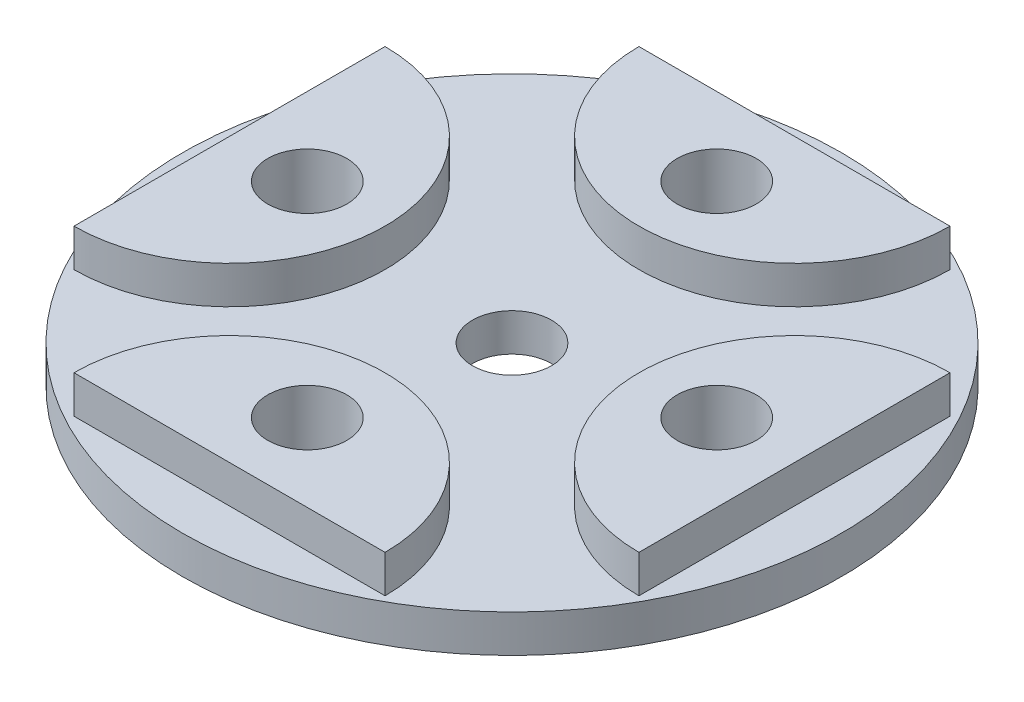
ISO-10303-21;
HEADER;
FILE_DESCRIPTION(('STEP AP214'),'2;1');
FILE_NAME('part.step','',(''),(''),'','','');
FILE_SCHEMA(('AUTOMOTIVE_DESIGN { 1 0 10303 214 1 1 1 1 }'));
ENDSEC;
DATA;
#1=APPLICATION_CONTEXT('core data for automotive mechanical design processes');
#2=APPLICATION_PROTOCOL_DEFINITION('international standard','automotive_design',2000,#1);
#3=PRODUCT_CONTEXT('',#1,'mechanical');
#4=PRODUCT('Part','Part','',(#3));
#5=PRODUCT_RELATED_PRODUCT_CATEGORY('part','',(#4));
#6=PRODUCT_DEFINITION_FORMATION('','',#4);
#7=PRODUCT_DEFINITION_CONTEXT('part definition',#1,'design');
#8=PRODUCT_DEFINITION('design','',#6,#7);
#9=PRODUCT_DEFINITION_SHAPE('','',#8);
#10=(LENGTH_UNIT() NAMED_UNIT(*) SI_UNIT(.MILLI.,.METRE.));
#11=(NAMED_UNIT(*) PLANE_ANGLE_UNIT() SI_UNIT($,.RADIAN.));
#12=(NAMED_UNIT(*) SI_UNIT($,.STERADIAN.) SOLID_ANGLE_UNIT());
#13=UNCERTAINTY_MEASURE_WITH_UNIT(LENGTH_MEASURE(1.E-05),#10,'distance_accuracy_value','');
#14=(GEOMETRIC_REPRESENTATION_CONTEXT(3) GLOBAL_UNCERTAINTY_ASSIGNED_CONTEXT((#13)) GLOBAL_UNIT_ASSIGNED_CONTEXT((#10,
#11,#12)) REPRESENTATION_CONTEXT('',''));
#15=CARTESIAN_POINT('',(0.,0.,0.));
#16=DIRECTION('',(0.,0.,1.));
#17=DIRECTION('',(1.,0.,0.));
#18=AXIS2_PLACEMENT_3D('',#15,#16,#17);
#19=CARTESIAN_POINT('',(0.,2.,0.));
#20=DIRECTION('',(0.,1.,0.));
#21=DIRECTION('',(0.,0.,1.));
#22=AXIS2_PLACEMENT_3D('',#19,#20,#21);
#23=PLANE('',#22);
#24=CARTESIAN_POINT('',(0.,2.,0.));
#25=DIRECTION('',(0.,1.,0.));
#26=DIRECTION('',(0.,0.,1.));
#27=AXIS2_PLACEMENT_3D('',#24,#25,#26);
#28=CIRCLE('',#27,17.5);
#29=CARTESIAN_POINT('',(0.,2.,17.5));
#30=VERTEX_POINT('',#29);
#31=EDGE_CURVE('E11',#30,#30,#28,.T.);
#32=ORIENTED_EDGE('',*,*,#31,.T.);
#33=EDGE_LOOP('',(#32));
#34=FACE_BOUND('',#33,.T.);
#35=CARTESIAN_POINT('',(0.,2.,0.));
#36=DIRECTION('',(0.,1.,0.));
#37=DIRECTION('',(0.,0.,1.));
#38=AXIS2_PLACEMENT_3D('',#35,#36,#37);
#39=CIRCLE('',#38,2.1);
#40=CARTESIAN_POINT('',(0.,2.,2.1));
#41=VERTEX_POINT('',#40);
#42=EDGE_CURVE('E167',#41,#41,#39,.T.);
#43=ORIENTED_EDGE('',*,*,#42,.F.);
#44=EDGE_LOOP('',(#43));
#45=FACE_BOUND('',#44,.T.);
#46=DIRECTION('',(1.,0.,0.));
#47=VECTOR('',#46,1.);
#48=CARTESIAN_POINT('',(0.,2.,-15.));
#49=LINE('',#48,#47);
#50=CARTESIAN_POINT('',(-8.26,2.,-15.));
#51=VERTEX_POINT('',#50);
#52=CARTESIAN_POINT('',(8.26,2.,-15.));
#53=VERTEX_POINT('',#52);
#54=EDGE_CURVE('E160',#51,#53,#49,.T.);
#55=ORIENTED_EDGE('',*,*,#54,.T.);
#56=CARTESIAN_POINT('',(0.,2.,-15.));
#57=DIRECTION('',(0.,1.,0.));
#58=DIRECTION('',(0.,0.,1.));
#59=AXIS2_PLACEMENT_3D('',#56,#57,#58);
#60=CIRCLE('',#59,8.26);
#61=EDGE_CURVE('E163',#53,#51,#60,.F.);
#62=ORIENTED_EDGE('',*,*,#61,.T.);
#63=EDGE_LOOP('',(#55,#62));
#64=FACE_BOUND('',#63,.T.);
#65=DIRECTION('',(0.,0.,1.));
#66=VECTOR('',#65,1.);
#67=CARTESIAN_POINT('',(15.,2.,0.));
#68=LINE('',#67,#66);
#69=CARTESIAN_POINT('',(15.,2.,-8.25999999999995));
#70=VERTEX_POINT('',#69);
#71=CARTESIAN_POINT('',(15.,2.,8.26000000000005));
#72=VERTEX_POINT('',#71);
#73=EDGE_CURVE('E144',#70,#72,#68,.T.);
#74=ORIENTED_EDGE('',*,*,#73,.T.);
#75=CARTESIAN_POINT('',(15.,2.,0.));
#76=DIRECTION('',(0.,1.,0.));
#77=DIRECTION('',(0.,0.,1.));
#78=AXIS2_PLACEMENT_3D('',#75,#76,#77);
#79=CIRCLE('',#78,8.26);
#80=EDGE_CURVE('E147',#72,#70,#79,.F.);
#81=ORIENTED_EDGE('',*,*,#80,.T.);
#82=EDGE_LOOP('',(#74,#81));
#83=FACE_BOUND('',#82,.T.);
#84=DIRECTION('',(-1.,0.,0.));
#85=VECTOR('',#84,1.);
#86=CARTESIAN_POINT('',(-1.03957399589409E-13,2.,15.));
#87=LINE('',#86,#85);
#88=CARTESIAN_POINT('',(8.2599999999999,2.,15.0000000000001));
#89=VERTEX_POINT('',#88);
#90=CARTESIAN_POINT('',(-8.2600000000001,2.,14.9999999999999));
#91=VERTEX_POINT('',#90);
#92=EDGE_CURVE('E128',#89,#91,#87,.T.);
#93=ORIENTED_EDGE('',*,*,#92,.T.);
#94=CARTESIAN_POINT('',(-1.04744440165294E-13,2.,15.));
#95=DIRECTION('',(0.,1.,0.));
#96=DIRECTION('',(0.,0.,1.));
#97=AXIS2_PLACEMENT_3D('',#94,#95,#96);
#98=CIRCLE('',#97,8.26);
#99=EDGE_CURVE('E131',#91,#89,#98,.F.);
#100=ORIENTED_EDGE('',*,*,#99,.T.);
#101=EDGE_LOOP('',(#93,#100));
#102=FACE_BOUND('',#101,.T.);
#103=DIRECTION('',(0.,0.,-1.));
#104=VECTOR('',#103,1.);
#105=CARTESIAN_POINT('',(-15.,2.,-1.57511211499105E-13));
#106=LINE('',#105,#104);
#107=CARTESIAN_POINT('',(-15.0000000000001,2.,8.25999999999984));
#108=VERTEX_POINT('',#107);
#109=CARTESIAN_POINT('',(-14.9999999999999,2.,-8.26000000000016));
#110=VERTEX_POINT('',#109);
#111=EDGE_CURVE('E113',#108,#110,#106,.T.);
#112=ORIENTED_EDGE('',*,*,#111,.T.);
#113=CARTESIAN_POINT('',(-15.,2.,-1.57116660247941E-13));
#114=DIRECTION('',(0.,1.,0.));
#115=DIRECTION('',(0.,0.,1.));
#116=AXIS2_PLACEMENT_3D('',#113,#114,#115);
#117=CIRCLE('',#116,8.26);
#118=EDGE_CURVE('E111',#110,#108,#117,.F.);
#119=ORIENTED_EDGE('',*,*,#118,.T.);
#120=EDGE_LOOP('',(#112,#119));
#121=FACE_BOUND('',#120,.T.);
#122=ADVANCED_FACE('F33',(#34,#45,#64,#83,#102,#121),#23,.T.);
#123=CARTESIAN_POINT('',(0.,0.,0.));
#124=DIRECTION('',(0.,1.,0.));
#125=DIRECTION('',(0.,0.,1.));
#126=AXIS2_PLACEMENT_3D('',#123,#124,#125);
#127=PLANE('',#126);
#128=CARTESIAN_POINT('',(0.,0.,-10.87));
#129=DIRECTION('',(0.,1.,0.));
#130=DIRECTION('',(0.,0.,1.));
#131=AXIS2_PLACEMENT_3D('',#128,#129,#130);
#132=CIRCLE('',#131,2.1);
#133=CARTESIAN_POINT('',(0.,0.,-8.77));
#134=VERTEX_POINT('',#133);
#135=EDGE_CURVE('E107',#134,#134,#132,.T.);
#136=ORIENTED_EDGE('',*,*,#135,.T.);
#137=EDGE_LOOP('',(#136));
#138=FACE_BOUND('',#137,.T.);
#139=CARTESIAN_POINT('',(10.8700000000003,0.,-3.05682747082362E-13));
#140=DIRECTION('',(0.,1.,0.));
#141=DIRECTION('',(0.,0.,1.));
#142=AXIS2_PLACEMENT_3D('',#139,#140,#141);
#143=CIRCLE('',#142,2.10000000000024);
#144=CARTESIAN_POINT('',(10.8700000000003,0.,2.09999999999993));
#145=VERTEX_POINT('',#144);
#146=EDGE_CURVE('E383',#145,#145,#143,.T.);
#147=ORIENTED_EDGE('',*,*,#146,.T.);
#148=EDGE_LOOP('',(#147));
#149=FACE_BOUND('',#148,.T.);
#150=CARTESIAN_POINT('',(6.11977916259443E-13,0.,10.87));
#151=DIRECTION('',(0.,1.,0.));
#152=DIRECTION('',(0.,0.,1.));
#153=AXIS2_PLACEMENT_3D('',#150,#151,#152);
#154=CIRCLE('',#153,2.1);
#155=CARTESIAN_POINT('',(6.11977916259443E-13,0.,12.97));
#156=VERTEX_POINT('',#155);
#157=EDGE_CURVE('E392',#156,#156,#154,.T.);
#158=ORIENTED_EDGE('',*,*,#157,.T.);
#159=EDGE_LOOP('',(#158));
#160=FACE_BOUND('',#159,.T.);
#161=CARTESIAN_POINT('',(-10.8699999999997,0.,3.03847658839063E-13));
#162=DIRECTION('',(0.,1.,0.));
#163=DIRECTION('',(0.,0.,1.));
#164=AXIS2_PLACEMENT_3D('',#161,#162,#163);
#165=CIRCLE('',#164,2.1);
#166=CARTESIAN_POINT('',(-10.8699999999997,0.,2.1000000000003));
#167=VERTEX_POINT('',#166);
#168=EDGE_CURVE('E398',#167,#167,#165,.T.);
#169=ORIENTED_EDGE('',*,*,#168,.T.);
#170=EDGE_LOOP('',(#169));
#171=FACE_BOUND('',#170,.T.);
#172=CARTESIAN_POINT('',(0.,0.,0.));
#173=DIRECTION('',(0.,1.,0.));
#174=DIRECTION('',(0.,0.,1.));
#175=AXIS2_PLACEMENT_3D('',#172,#173,#174);
#176=CIRCLE('',#175,17.5);
#177=CARTESIAN_POINT('',(0.,0.,17.5));
#178=VERTEX_POINT('',#177);
#179=EDGE_CURVE('E37',#178,#178,#176,.T.);
#180=ORIENTED_EDGE('',*,*,#179,.F.);
#181=EDGE_LOOP('',(#180));
#182=FACE_BOUND('',#181,.T.);
#183=CARTESIAN_POINT('',(0.,0.,0.));
#184=DIRECTION('',(0.,1.,0.));
#185=DIRECTION('',(0.,0.,1.));
#186=AXIS2_PLACEMENT_3D('',#183,#184,#185);
#187=CIRCLE('',#186,2.1);
#188=CARTESIAN_POINT('',(0.,0.,2.1));
#189=VERTEX_POINT('',#188);
#190=EDGE_CURVE('E166',#189,#189,#187,.T.);
#191=ORIENTED_EDGE('',*,*,#190,.T.);
#192=EDGE_LOOP('',(#191));
#193=FACE_BOUND('',#192,.T.);
#194=ADVANCED_FACE('F173',(#138,#149,#160,#171,#182,#193),#127,.F.);
#195=CARTESIAN_POINT('',(0.,2.,0.));
#196=DIRECTION('',(0.,-1.,0.));
#197=DIRECTION('',(0.,0.,-1.));
#198=AXIS2_PLACEMENT_3D('',#195,#196,#197);
#199=CYLINDRICAL_SURFACE('',#198,17.5);
#200=ORIENTED_EDGE('',*,*,#31,.F.);
#201=EDGE_LOOP('',(#200));
#202=FACE_BOUND('',#201,.T.);
#203=ORIENTED_EDGE('',*,*,#179,.T.);
#204=EDGE_LOOP('',(#203));
#205=FACE_BOUND('',#204,.T.);
#206=ADVANCED_FACE('F35',(#202,#205),#199,.T.);
#207=CARTESIAN_POINT('',(0.,2.,0.));
#208=DIRECTION('',(0.,-1.,0.));
#209=DIRECTION('',(0.,0.,-1.));
#210=AXIS2_PLACEMENT_3D('',#207,#208,#209);
#211=CYLINDRICAL_SURFACE('',#210,2.1);
#212=ORIENTED_EDGE('',*,*,#42,.T.);
#213=EDGE_LOOP('',(#212));
#214=FACE_BOUND('',#213,.T.);
#215=ORIENTED_EDGE('',*,*,#190,.F.);
#216=EDGE_LOOP('',(#215));
#217=FACE_BOUND('',#216,.T.);
#218=ADVANCED_FACE('F175',(#214,#217),#211,.F.);
#219=CARTESIAN_POINT('',(0.,4.,-15.));
#220=DIRECTION('',(0.,-1.,0.));
#221=DIRECTION('',(0.,0.,-1.));
#222=AXIS2_PLACEMENT_3D('',#219,#220,#221);
#223=CYLINDRICAL_SURFACE('',#222,8.26);
#224=ORIENTED_EDGE('',*,*,#61,.F.);
#225=DIRECTION('',(0.,-1.,0.));
#226=VECTOR('',#225,1.);
#227=CARTESIAN_POINT('',(8.26,4.,-15.));
#228=LINE('',#227,#226);
#229=CARTESIAN_POINT('',(8.26,4.,-15.));
#230=VERTEX_POINT('',#229);
#231=EDGE_CURVE('E158',#230,#53,#228,.T.);
#232=ORIENTED_EDGE('',*,*,#231,.F.);
#233=CARTESIAN_POINT('',(0.,4.,-15.));
#234=DIRECTION('',(0.,1.,0.));
#235=DIRECTION('',(0.,0.,1.));
#236=AXIS2_PLACEMENT_3D('',#233,#234,#235);
#237=CIRCLE('',#236,8.26);
#238=CARTESIAN_POINT('',(-8.26,4.,-15.));
#239=VERTEX_POINT('',#238);
#240=EDGE_CURVE('E150',#239,#230,#237,.T.);
#241=ORIENTED_EDGE('',*,*,#240,.F.);
#242=DIRECTION('',(0.,-1.,0.));
#243=VECTOR('',#242,1.);
#244=CARTESIAN_POINT('',(-8.26,4.,-15.));
#245=LINE('',#244,#243);
#246=EDGE_CURVE('E155',#239,#51,#245,.T.);
#247=ORIENTED_EDGE('',*,*,#246,.T.);
#248=EDGE_LOOP('',(#224,#232,#241,#247));
#249=FACE_BOUND('',#248,.T.);
#250=ADVANCED_FACE('F177',(#249),#223,.T.);
#251=CARTESIAN_POINT('',(-8.26,4.,-15.));
#252=DIRECTION('',(0.,0.,1.));
#253=DIRECTION('',(1.,0.,0.));
#254=AXIS2_PLACEMENT_3D('',#251,#252,#253);
#255=PLANE('',#254);
#256=ORIENTED_EDGE('',*,*,#54,.F.);
#257=ORIENTED_EDGE('',*,*,#246,.F.);
#258=DIRECTION('',(-1.,0.,0.));
#259=VECTOR('',#258,1.);
#260=CARTESIAN_POINT('',(-8.26,4.,-15.));
#261=LINE('',#260,#259);
#262=EDGE_CURVE('E153',#230,#239,#261,.T.);
#263=ORIENTED_EDGE('',*,*,#262,.F.);
#264=ORIENTED_EDGE('',*,*,#231,.T.);
#265=EDGE_LOOP('',(#256,#257,#263,#264));
#266=FACE_BOUND('',#265,.T.);
#267=ADVANCED_FACE('F184',(#266),#255,.F.);
#268=CARTESIAN_POINT('',(0.,4.,-15.));
#269=DIRECTION('',(0.,1.,0.));
#270=DIRECTION('',(0.,0.,1.));
#271=AXIS2_PLACEMENT_3D('',#268,#269,#270);
#272=PLANE('',#271);
#273=CARTESIAN_POINT('',(0.,4.,-10.87));
#274=DIRECTION('',(0.,1.,0.));
#275=DIRECTION('',(0.,0.,1.));
#276=AXIS2_PLACEMENT_3D('',#273,#274,#275);
#277=CIRCLE('',#276,2.1);
#278=CARTESIAN_POINT('',(0.,4.,-8.77));
#279=VERTEX_POINT('',#278);
#280=EDGE_CURVE('E382',#279,#279,#277,.T.);
#281=ORIENTED_EDGE('',*,*,#280,.F.);
#282=EDGE_LOOP('',(#281));
#283=FACE_BOUND('',#282,.T.);
#284=ORIENTED_EDGE('',*,*,#240,.T.);
#285=ORIENTED_EDGE('',*,*,#262,.T.);
#286=EDGE_LOOP('',(#284,#285));
#287=FACE_BOUND('',#286,.T.);
#288=ADVANCED_FACE('F234',(#283,#287),#272,.T.);
#289=CARTESIAN_POINT('',(15.,4.,0.));
#290=DIRECTION('',(0.,-1.,0.));
#291=DIRECTION('',(0.,0.,-1.));
#292=AXIS2_PLACEMENT_3D('',#289,#290,#291);
#293=CYLINDRICAL_SURFACE('',#292,8.26);
#294=ORIENTED_EDGE('',*,*,#80,.F.);
#295=DIRECTION('',(0.,-1.,0.));
#296=VECTOR('',#295,1.);
#297=CARTESIAN_POINT('',(15.,4.,8.26000000000005));
#298=LINE('',#297,#296);
#299=CARTESIAN_POINT('',(15.,4.,8.26000000000005));
#300=VERTEX_POINT('',#299);
#301=EDGE_CURVE('E142',#300,#72,#298,.T.);
#302=ORIENTED_EDGE('',*,*,#301,.F.);
#303=CARTESIAN_POINT('',(15.,4.,0.));
#304=DIRECTION('',(0.,1.,0.));
#305=DIRECTION('',(0.,0.,1.));
#306=AXIS2_PLACEMENT_3D('',#303,#304,#305);
#307=CIRCLE('',#306,8.26);
#308=CARTESIAN_POINT('',(15.,4.,-8.25999999999995));
#309=VERTEX_POINT('',#308);
#310=EDGE_CURVE('E134',#309,#300,#307,.T.);
#311=ORIENTED_EDGE('',*,*,#310,.F.);
#312=DIRECTION('',(0.,-1.,0.));
#313=VECTOR('',#312,1.);
#314=CARTESIAN_POINT('',(15.,4.,-8.25999999999995));
#315=LINE('',#314,#313);
#316=EDGE_CURVE('E139',#309,#70,#315,.T.);
#317=ORIENTED_EDGE('',*,*,#316,.T.);
#318=EDGE_LOOP('',(#294,#302,#311,#317));
#319=FACE_BOUND('',#318,.T.);
#320=ADVANCED_FACE('F230',(#319),#293,.T.);
#321=CARTESIAN_POINT('',(15.,4.,-8.25999999999995));
#322=DIRECTION('',(-1.,0.,0.));
#323=DIRECTION('',(0.,0.,1.));
#324=AXIS2_PLACEMENT_3D('',#321,#322,#323);
#325=PLANE('',#324);
#326=ORIENTED_EDGE('',*,*,#73,.F.);
#327=ORIENTED_EDGE('',*,*,#316,.F.);
#328=DIRECTION('',(0.,0.,-1.));
#329=VECTOR('',#328,1.);
#330=CARTESIAN_POINT('',(15.,4.,-8.25999999999995));
#331=LINE('',#330,#329);
#332=EDGE_CURVE('E137',#300,#309,#331,.T.);
#333=ORIENTED_EDGE('',*,*,#332,.F.);
#334=ORIENTED_EDGE('',*,*,#301,.T.);
#335=EDGE_LOOP('',(#326,#327,#333,#334));
#336=FACE_BOUND('',#335,.T.);
#337=ADVANCED_FACE('F226',(#336),#325,.F.);
#338=CARTESIAN_POINT('',(15.,4.,0.));
#339=DIRECTION('',(0.,1.,0.));
#340=DIRECTION('',(0.,0.,1.));
#341=AXIS2_PLACEMENT_3D('',#338,#339,#340);
#342=PLANE('',#341);
#343=CARTESIAN_POINT('',(10.8700000000003,4.,-3.05682747082362E-13));
#344=DIRECTION('',(0.,1.,0.));
#345=DIRECTION('',(0.,0.,1.));
#346=AXIS2_PLACEMENT_3D('',#343,#344,#345);
#347=CIRCLE('',#346,2.10000000000024);
#348=CARTESIAN_POINT('',(10.8700000000003,4.,2.09999999999993));
#349=VERTEX_POINT('',#348);
#350=EDGE_CURVE('E387',#349,#349,#347,.T.);
#351=ORIENTED_EDGE('',*,*,#350,.F.);
#352=EDGE_LOOP('',(#351));
#353=FACE_BOUND('',#352,.T.);
#354=ORIENTED_EDGE('',*,*,#310,.T.);
#355=ORIENTED_EDGE('',*,*,#332,.T.);
#356=EDGE_LOOP('',(#354,#355));
#357=FACE_BOUND('',#356,.T.);
#358=ADVANCED_FACE('F223',(#353,#357),#342,.T.);
#359=CARTESIAN_POINT('',(-1.04744440165294E-13,4.,15.));
#360=DIRECTION('',(0.,-1.,0.));
#361=DIRECTION('',(0.,0.,-1.));
#362=AXIS2_PLACEMENT_3D('',#359,#360,#361);
#363=CYLINDRICAL_SURFACE('',#362,8.26);
#364=ORIENTED_EDGE('',*,*,#99,.F.);
#365=DIRECTION('',(0.,-1.,0.));
#366=VECTOR('',#365,1.);
#367=CARTESIAN_POINT('',(-8.2600000000001,4.,14.9999999999999));
#368=LINE('',#367,#366);
#369=CARTESIAN_POINT('',(-8.2600000000001,4.,14.9999999999999));
#370=VERTEX_POINT('',#369);
#371=EDGE_CURVE('E56',#370,#91,#368,.T.);
#372=ORIENTED_EDGE('',*,*,#371,.F.);
#373=CARTESIAN_POINT('',(-1.04744440165294E-13,4.,15.));
#374=DIRECTION('',(0.,1.,0.));
#375=DIRECTION('',(0.,0.,1.));
#376=AXIS2_PLACEMENT_3D('',#373,#374,#375);
#377=CIRCLE('',#376,8.26);
#378=CARTESIAN_POINT('',(8.2599999999999,4.,15.0000000000001));
#379=VERTEX_POINT('',#378);
#380=EDGE_CURVE('E119',#379,#370,#377,.T.);
#381=ORIENTED_EDGE('',*,*,#380,.F.);
#382=DIRECTION('',(0.,-1.,0.));
#383=VECTOR('',#382,1.);
#384=CARTESIAN_POINT('',(8.2599999999999,4.,15.0000000000001));
#385=LINE('',#384,#383);
#386=EDGE_CURVE('E124',#379,#89,#385,.T.);
#387=ORIENTED_EDGE('',*,*,#386,.T.);
#388=EDGE_LOOP('',(#364,#372,#381,#387));
#389=FACE_BOUND('',#388,.T.);
#390=ADVANCED_FACE('F206',(#389),#363,.T.);
#391=CARTESIAN_POINT('',(8.2599999999999,4.,15.0000000000001));
#392=DIRECTION('',(0.,0.,-1.));
#393=DIRECTION('',(-1.,0.,0.));
#394=AXIS2_PLACEMENT_3D('',#391,#392,#393);
#395=PLANE('',#394);
#396=ORIENTED_EDGE('',*,*,#92,.F.);
#397=ORIENTED_EDGE('',*,*,#386,.F.);
#398=DIRECTION('',(1.,0.,0.));
#399=VECTOR('',#398,1.);
#400=CARTESIAN_POINT('',(8.2599999999999,4.,15.0000000000001));
#401=LINE('',#400,#399);
#402=EDGE_CURVE('E122',#370,#379,#401,.T.);
#403=ORIENTED_EDGE('',*,*,#402,.F.);
#404=ORIENTED_EDGE('',*,*,#371,.T.);
#405=EDGE_LOOP('',(#396,#397,#403,#404));
#406=FACE_BOUND('',#405,.T.);
#407=ADVANCED_FACE('F203',(#406),#395,.F.);
#408=CARTESIAN_POINT('',(-1.04744440165294E-13,4.,15.));
#409=DIRECTION('',(0.,1.,0.));
#410=DIRECTION('',(0.,0.,1.));
#411=AXIS2_PLACEMENT_3D('',#408,#409,#410);
#412=PLANE('',#411);
#413=CARTESIAN_POINT('',(6.11977916259443E-13,4.,10.87));
#414=DIRECTION('',(0.,1.,0.));
#415=DIRECTION('',(0.,0.,1.));
#416=AXIS2_PLACEMENT_3D('',#413,#414,#415);
#417=CIRCLE('',#416,2.1);
#418=CARTESIAN_POINT('',(6.11977916259443E-13,4.,12.97));
#419=VERTEX_POINT('',#418);
#420=EDGE_CURVE('E395',#419,#419,#417,.T.);
#421=ORIENTED_EDGE('',*,*,#420,.F.);
#422=EDGE_LOOP('',(#421));
#423=FACE_BOUND('',#422,.T.);
#424=ORIENTED_EDGE('',*,*,#380,.T.);
#425=ORIENTED_EDGE('',*,*,#402,.T.);
#426=EDGE_LOOP('',(#424,#425));
#427=FACE_BOUND('',#426,.T.);
#428=ADVANCED_FACE('F208',(#423,#427),#412,.T.);
#429=CARTESIAN_POINT('',(-15.,4.,-1.57116660247941E-13));
#430=DIRECTION('',(0.,-1.,0.));
#431=DIRECTION('',(0.,0.,-1.));
#432=AXIS2_PLACEMENT_3D('',#429,#430,#431);
#433=CYLINDRICAL_SURFACE('',#432,8.26);
#434=ORIENTED_EDGE('',*,*,#118,.F.);
#435=DIRECTION('',(0.,-1.,0.));
#436=VECTOR('',#435,1.);
#437=CARTESIAN_POINT('',(-14.9999999999999,4.,-8.26000000000016));
#438=LINE('',#437,#436);
#439=CARTESIAN_POINT('',(-14.9999999999999,4.,-8.26000000000016));
#440=VERTEX_POINT('',#439);
#441=EDGE_CURVE('E48',#440,#110,#438,.T.);
#442=ORIENTED_EDGE('',*,*,#441,.F.);
#443=CARTESIAN_POINT('',(-15.,4.,-1.57116660247941E-13));
#444=DIRECTION('',(0.,1.,0.));
#445=DIRECTION('',(0.,0.,1.));
#446=AXIS2_PLACEMENT_3D('',#443,#444,#445);
#447=CIRCLE('',#446,8.26);
#448=CARTESIAN_POINT('',(-15.0000000000001,4.,8.25999999999984));
#449=VERTEX_POINT('',#448);
#450=EDGE_CURVE('E103',#449,#440,#447,.T.);
#451=ORIENTED_EDGE('',*,*,#450,.F.);
#452=DIRECTION('',(0.,-1.,0.));
#453=VECTOR('',#452,1.);
#454=CARTESIAN_POINT('',(-15.0000000000001,4.,8.25999999999984));
#455=LINE('',#454,#453);
#456=EDGE_CURVE('E100',#449,#108,#455,.T.);
#457=ORIENTED_EDGE('',*,*,#456,.T.);
#458=EDGE_LOOP('',(#434,#442,#451,#457));
#459=FACE_BOUND('',#458,.T.);
#460=ADVANCED_FACE('F109',(#459),#433,.T.);
#461=CARTESIAN_POINT('',(-15.0000000000001,4.,8.25999999999984));
#462=DIRECTION('',(1.,0.,0.));
#463=DIRECTION('',(0.,0.,-1.));
#464=AXIS2_PLACEMENT_3D('',#461,#462,#463);
#465=PLANE('',#464);
#466=ORIENTED_EDGE('',*,*,#111,.F.);
#467=ORIENTED_EDGE('',*,*,#456,.F.);
#468=DIRECTION('',(0.,0.,1.));
#469=VECTOR('',#468,1.);
#470=CARTESIAN_POINT('',(-15.0000000000001,4.,8.25999999999984));
#471=LINE('',#470,#469);
#472=EDGE_CURVE('E96',#440,#449,#471,.T.);
#473=ORIENTED_EDGE('',*,*,#472,.F.);
#474=ORIENTED_EDGE('',*,*,#441,.T.);
#475=EDGE_LOOP('',(#466,#467,#473,#474));
#476=FACE_BOUND('',#475,.T.);
#477=ADVANCED_FACE('F98',(#476),#465,.F.);
#478=CARTESIAN_POINT('',(-15.,4.,-1.57116660247941E-13));
#479=DIRECTION('',(0.,1.,0.));
#480=DIRECTION('',(0.,0.,1.));
#481=AXIS2_PLACEMENT_3D('',#478,#479,#480);
#482=PLANE('',#481);
#483=CARTESIAN_POINT('',(-10.8699999999997,4.,3.03847658839063E-13));
#484=DIRECTION('',(0.,1.,0.));
#485=DIRECTION('',(0.,0.,1.));
#486=AXIS2_PLACEMENT_3D('',#483,#484,#485);
#487=CIRCLE('',#486,2.1);
#488=CARTESIAN_POINT('',(-10.8699999999997,4.,2.1000000000003));
#489=VERTEX_POINT('',#488);
#490=EDGE_CURVE('E401',#489,#489,#487,.T.);
#491=ORIENTED_EDGE('',*,*,#490,.F.);
#492=EDGE_LOOP('',(#491));
#493=FACE_BOUND('',#492,.T.);
#494=ORIENTED_EDGE('',*,*,#450,.T.);
#495=ORIENTED_EDGE('',*,*,#472,.T.);
#496=EDGE_LOOP('',(#494,#495));
#497=FACE_BOUND('',#496,.T.);
#498=ADVANCED_FACE('F105',(#493,#497),#482,.T.);
#499=CARTESIAN_POINT('',(-10.8699999999997,0.,3.03847658839063E-13));
#500=DIRECTION('',(0.,1.,0.));
#501=DIRECTION('',(0.,0.,1.));
#502=AXIS2_PLACEMENT_3D('',#499,#500,#501);
#503=CYLINDRICAL_SURFACE('',#502,2.1);
#504=ORIENTED_EDGE('',*,*,#168,.F.);
#505=EDGE_LOOP('',(#504));
#506=FACE_BOUND('',#505,.T.);
#507=ORIENTED_EDGE('',*,*,#490,.T.);
#508=EDGE_LOOP('',(#507));
#509=FACE_BOUND('',#508,.T.);
#510=ADVANCED_FACE('F333',(#506,#509),#503,.F.);
#511=CARTESIAN_POINT('',(6.11977916259443E-13,0.,10.87));
#512=DIRECTION('',(0.,1.,0.));
#513=DIRECTION('',(0.,0.,1.));
#514=AXIS2_PLACEMENT_3D('',#511,#512,#513);
#515=CYLINDRICAL_SURFACE('',#514,2.1);
#516=ORIENTED_EDGE('',*,*,#157,.F.);
#517=EDGE_LOOP('',(#516));
#518=FACE_BOUND('',#517,.T.);
#519=ORIENTED_EDGE('',*,*,#420,.T.);
#520=EDGE_LOOP('',(#519));
#521=FACE_BOUND('',#520,.T.);
#522=ADVANCED_FACE('F340',(#518,#521),#515,.F.);
#523=CARTESIAN_POINT('',(10.8700000000003,0.,-3.05682747082362E-13));
#524=DIRECTION('',(0.,1.,0.));
#525=DIRECTION('',(0.,0.,1.));
#526=AXIS2_PLACEMENT_3D('',#523,#524,#525);
#527=CYLINDRICAL_SURFACE('',#526,2.10000000000024);
#528=ORIENTED_EDGE('',*,*,#146,.F.);
#529=EDGE_LOOP('',(#528));
#530=FACE_BOUND('',#529,.T.);
#531=ORIENTED_EDGE('',*,*,#350,.T.);
#532=EDGE_LOOP('',(#531));
#533=FACE_BOUND('',#532,.T.);
#534=ADVANCED_FACE('F348',(#530,#533),#527,.F.);
#535=CARTESIAN_POINT('',(0.,0.,-10.87));
#536=DIRECTION('',(0.,1.,0.));
#537=DIRECTION('',(0.,0.,1.));
#538=AXIS2_PLACEMENT_3D('',#535,#536,#537);
#539=CYLINDRICAL_SURFACE('',#538,2.1);
#540=ORIENTED_EDGE('',*,*,#135,.F.);
#541=EDGE_LOOP('',(#540));
#542=FACE_BOUND('',#541,.T.);
#543=ORIENTED_EDGE('',*,*,#280,.T.);
#544=EDGE_LOOP('',(#543));
#545=FACE_BOUND('',#544,.T.);
#546=ADVANCED_FACE('F356',(#542,#545),#539,.F.);
#547=CLOSED_SHELL('',(#122,#194,#206,#218,#250,#267,#288,#320,#337,#358,#390,#407,#428,#460,
#477,#498,#510,#522,#534,#546));
#548=MANIFOLD_SOLID_BREP('B2',#547);
#549=ADVANCED_BREP_SHAPE_REPRESENTATION('',(#18,#548),#14);
#550=SHAPE_DEFINITION_REPRESENTATION(#9,#549);
ENDSEC;
END-ISO-10303-21;
